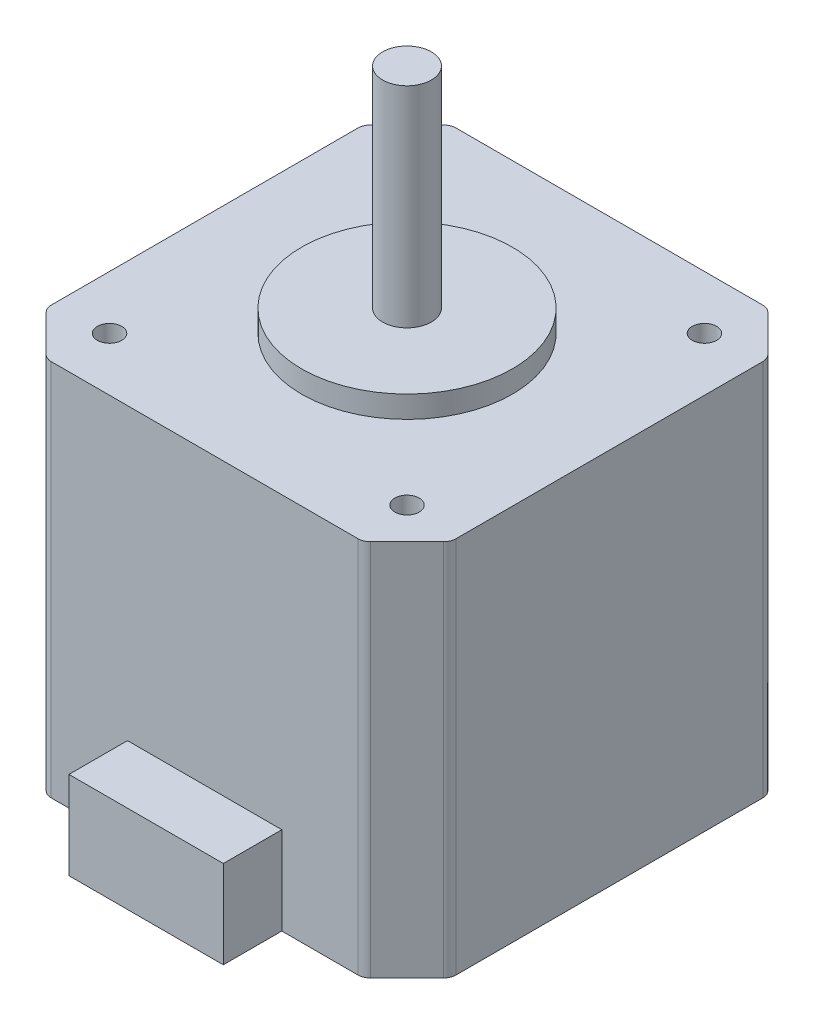
ISO-10303-21;
HEADER;
FILE_DESCRIPTION(('STEP AP214'),'2;1');
FILE_NAME('part.step','',(''),(''),'','','');
FILE_SCHEMA(('AUTOMOTIVE_DESIGN { 1 0 10303 214 1 1 1 1 }'));
ENDSEC;
DATA;
#1=APPLICATION_CONTEXT('core data for automotive mechanical design processes');
#2=APPLICATION_PROTOCOL_DEFINITION('international standard','automotive_design',2000,#1);
#3=PRODUCT_CONTEXT('',#1,'mechanical');
#4=PRODUCT('Part','Part','',(#3));
#5=PRODUCT_RELATED_PRODUCT_CATEGORY('part','',(#4));
#6=PRODUCT_DEFINITION_FORMATION('','',#4);
#7=PRODUCT_DEFINITION_CONTEXT('part definition',#1,'design');
#8=PRODUCT_DEFINITION('design','',#6,#7);
#9=PRODUCT_DEFINITION_SHAPE('','',#8);
#10=(LENGTH_UNIT() NAMED_UNIT(*) SI_UNIT(.MILLI.,.METRE.));
#11=(NAMED_UNIT(*) PLANE_ANGLE_UNIT() SI_UNIT($,.RADIAN.));
#12=(NAMED_UNIT(*) SI_UNIT($,.STERADIAN.) SOLID_ANGLE_UNIT());
#13=UNCERTAINTY_MEASURE_WITH_UNIT(LENGTH_MEASURE(1.E-05),#10,'distance_accuracy_value','');
#14=(GEOMETRIC_REPRESENTATION_CONTEXT(3) GLOBAL_UNCERTAINTY_ASSIGNED_CONTEXT((#13)) GLOBAL_UNIT_ASSIGNED_CONTEXT((#10,
#11,#12)) REPRESENTATION_CONTEXT('',''));
#15=CARTESIAN_POINT('',(0.,0.,0.));
#16=DIRECTION('',(0.,0.,1.));
#17=DIRECTION('',(1.,0.,0.));
#18=AXIS2_PLACEMENT_3D('',#15,#16,#17);
#19=CARTESIAN_POINT('',(0.,39.37,21.082));
#20=DIRECTION('',(0.,0.,-1.));
#21=DIRECTION('',(-1.,0.,0.));
#22=AXIS2_PLACEMENT_3D('',#19,#20,#21);
#23=PLANE('',#22);
#24=DIRECTION('',(1.,0.,0.));
#25=VECTOR('',#24,1.);
#26=CARTESIAN_POINT('',(0.,0.,21.082));
#27=LINE('',#26,#25);
#28=CARTESIAN_POINT('',(8.0391,0.,21.082));
#29=VERTEX_POINT('',#28);
#30=CARTESIAN_POINT('',(15.9839487757862,0.,21.082));
#31=VERTEX_POINT('',#30);
#32=EDGE_CURVE('E185',#29,#31,#27,.T.);
#33=ORIENTED_EDGE('',*,*,#32,.T.);
#34=DIRECTION('',(0.,1.,0.));
#35=VECTOR('',#34,1.);
#36=CARTESIAN_POINT('',(15.9839487757862,39.37,21.082));
#37=LINE('',#36,#35);
#38=CARTESIAN_POINT('',(15.9839487757862,39.37,21.082));
#39=VERTEX_POINT('',#38);
#40=EDGE_CURVE('E304',#31,#39,#37,.T.);
#41=ORIENTED_EDGE('',*,*,#40,.T.);
#42=DIRECTION('',(1.,0.,0.));
#43=VECTOR('',#42,1.);
#44=CARTESIAN_POINT('',(0.,39.37,21.082));
#45=LINE('',#44,#43);
#46=CARTESIAN_POINT('',(-15.9839487757862,39.37,21.082));
#47=VERTEX_POINT('',#46);
#48=EDGE_CURVE('E217',#47,#39,#45,.T.);
#49=ORIENTED_EDGE('',*,*,#48,.F.);
#50=DIRECTION('',(0.,1.,0.));
#51=VECTOR('',#50,1.);
#52=CARTESIAN_POINT('',(-15.9839487757862,39.37,21.082));
#53=LINE('',#52,#51);
#54=CARTESIAN_POINT('',(-15.9839487757862,0.,21.082));
#55=VERTEX_POINT('',#54);
#56=EDGE_CURVE('E302',#47,#55,#53,.F.);
#57=ORIENTED_EDGE('',*,*,#56,.T.);
#58=CARTESIAN_POINT('',(-8.03909999999999,0.,21.082));
#59=VERTEX_POINT('',#58);
#60=EDGE_CURVE('E231',#55,#59,#27,.T.);
#61=ORIENTED_EDGE('',*,*,#60,.T.);
#62=DIRECTION('',(0.,-1.,0.));
#63=VECTOR('',#62,1.);
#64=CARTESIAN_POINT('',(-8.03909999999999,9.144,21.082));
#65=LINE('',#64,#63);
#66=CARTESIAN_POINT('',(-8.03909999999999,9.144,21.082));
#67=VERTEX_POINT('',#66);
#68=EDGE_CURVE('E186',#67,#59,#65,.T.);
#69=ORIENTED_EDGE('',*,*,#68,.F.);
#70=DIRECTION('',(1.,0.,0.));
#71=VECTOR('',#70,1.);
#72=CARTESIAN_POINT('',(0.,9.144,21.082));
#73=LINE('',#72,#71);
#74=CARTESIAN_POINT('',(8.0391,9.144,21.082));
#75=VERTEX_POINT('',#74);
#76=EDGE_CURVE('E191',#67,#75,#73,.T.);
#77=ORIENTED_EDGE('',*,*,#76,.T.);
#78=DIRECTION('',(0.,-1.,0.));
#79=VECTOR('',#78,1.);
#80=CARTESIAN_POINT('',(8.0391,9.144,21.082));
#81=LINE('',#80,#79);
#82=EDGE_CURVE('E177',#75,#29,#81,.T.);
#83=ORIENTED_EDGE('',*,*,#82,.T.);
#84=EDGE_LOOP('',(#33,#41,#49,#57,#61,#69,#77,#83));
#85=FACE_BOUND('',#84,.T.);
#86=ADVANCED_FACE('F38',(#85),#23,.F.);
#87=CARTESIAN_POINT('',(21.082,39.37,0.));
#88=DIRECTION('',(-1.,0.,0.));
#89=DIRECTION('',(0.,0.,1.));
#90=AXIS2_PLACEMENT_3D('',#87,#88,#89);
#91=PLANE('',#90);
#92=DIRECTION('',(0.,0.,-1.));
#93=VECTOR('',#92,1.);
#94=CARTESIAN_POINT('',(21.082,0.,0.));
#95=LINE('',#94,#93);
#96=CARTESIAN_POINT('',(21.082,0.,15.9839487757862));
#97=VERTEX_POINT('',#96);
#98=CARTESIAN_POINT('',(21.082,0.,-15.9839487757862));
#99=VERTEX_POINT('',#98);
#100=EDGE_CURVE('E233',#97,#99,#95,.T.);
#101=ORIENTED_EDGE('',*,*,#100,.T.);
#102=DIRECTION('',(0.,1.,0.));
#103=VECTOR('',#102,1.);
#104=CARTESIAN_POINT('',(21.082,39.37,-15.9839487757862));
#105=LINE('',#104,#103);
#106=CARTESIAN_POINT('',(21.082,39.37,-15.9839487757862));
#107=VERTEX_POINT('',#106);
#108=EDGE_CURVE('E295',#99,#107,#105,.T.);
#109=ORIENTED_EDGE('',*,*,#108,.T.);
#110=DIRECTION('',(0.,0.,-1.));
#111=VECTOR('',#110,1.);
#112=CARTESIAN_POINT('',(21.082,39.37,0.));
#113=LINE('',#112,#111);
#114=CARTESIAN_POINT('',(21.082,39.37,15.9839487757862));
#115=VERTEX_POINT('',#114);
#116=EDGE_CURVE('E220',#115,#107,#113,.T.);
#117=ORIENTED_EDGE('',*,*,#116,.F.);
#118=DIRECTION('',(0.,1.,0.));
#119=VECTOR('',#118,1.);
#120=CARTESIAN_POINT('',(21.082,39.37,15.9839487757862));
#121=LINE('',#120,#119);
#122=EDGE_CURVE('E293',#115,#97,#121,.F.);
#123=ORIENTED_EDGE('',*,*,#122,.T.);
#124=EDGE_LOOP('',(#101,#109,#117,#123));
#125=FACE_BOUND('',#124,.T.);
#126=ADVANCED_FACE('F386',(#125),#91,.F.);
#127=CARTESIAN_POINT('',(0.,39.37,-21.082));
#128=DIRECTION('',(0.,0.,-1.));
#129=DIRECTION('',(-1.,0.,0.));
#130=AXIS2_PLACEMENT_3D('',#127,#128,#129);
#131=PLANE('',#130);
#132=DIRECTION('',(1.,0.,0.));
#133=VECTOR('',#132,1.);
#134=CARTESIAN_POINT('',(0.,0.,-21.082));
#135=LINE('',#134,#133);
#136=CARTESIAN_POINT('',(-15.9839487757862,0.,-21.082));
#137=VERTEX_POINT('',#136);
#138=CARTESIAN_POINT('',(15.9839487757862,0.,-21.082));
#139=VERTEX_POINT('',#138);
#140=EDGE_CURVE('E236',#137,#139,#135,.T.);
#141=ORIENTED_EDGE('',*,*,#140,.F.);
#142=DIRECTION('',(0.,1.,0.));
#143=VECTOR('',#142,1.);
#144=CARTESIAN_POINT('',(-15.9839487757862,39.37,-21.082));
#145=LINE('',#144,#143);
#146=CARTESIAN_POINT('',(-15.9839487757862,39.37,-21.082));
#147=VERTEX_POINT('',#146);
#148=EDGE_CURVE('E285',#137,#147,#145,.T.);
#149=ORIENTED_EDGE('',*,*,#148,.T.);
#150=DIRECTION('',(1.,0.,0.));
#151=VECTOR('',#150,1.);
#152=CARTESIAN_POINT('',(0.,39.37,-21.082));
#153=LINE('',#152,#151);
#154=CARTESIAN_POINT('',(15.9839487757862,39.37,-21.082));
#155=VERTEX_POINT('',#154);
#156=EDGE_CURVE('E224',#147,#155,#153,.T.);
#157=ORIENTED_EDGE('',*,*,#156,.T.);
#158=DIRECTION('',(0.,1.,0.));
#159=VECTOR('',#158,1.);
#160=CARTESIAN_POINT('',(15.9839487757862,0.,-21.082));
#161=LINE('',#160,#159);
#162=EDGE_CURVE('E283',#155,#139,#161,.F.);
#163=ORIENTED_EDGE('',*,*,#162,.T.);
#164=EDGE_LOOP('',(#141,#149,#157,#163));
#165=FACE_BOUND('',#164,.T.);
#166=ADVANCED_FACE('F381',(#165),#131,.T.);
#167=CARTESIAN_POINT('',(-21.082,39.37,0.));
#168=DIRECTION('',(-1.,0.,0.));
#169=DIRECTION('',(0.,0.,1.));
#170=AXIS2_PLACEMENT_3D('',#167,#168,#169);
#171=PLANE('',#170);
#172=DIRECTION('',(0.,0.,-1.));
#173=VECTOR('',#172,1.);
#174=CARTESIAN_POINT('',(-21.082,39.37,0.));
#175=LINE('',#174,#173);
#176=CARTESIAN_POINT('',(-21.082,39.37,15.9839487757862));
#177=VERTEX_POINT('',#176);
#178=CARTESIAN_POINT('',(-21.082,39.37,-15.9839487757862));
#179=VERTEX_POINT('',#178);
#180=EDGE_CURVE('E227',#177,#179,#175,.T.);
#181=ORIENTED_EDGE('',*,*,#180,.T.);
#182=DIRECTION('',(0.,1.,0.));
#183=VECTOR('',#182,1.);
#184=CARTESIAN_POINT('',(-21.082,0.,-15.9839487757862));
#185=LINE('',#184,#183);
#186=CARTESIAN_POINT('',(-21.082,0.,-15.9839487757862));
#187=VERTEX_POINT('',#186);
#188=EDGE_CURVE('E266',#179,#187,#185,.F.);
#189=ORIENTED_EDGE('',*,*,#188,.T.);
#190=DIRECTION('',(0.,0.,-1.));
#191=VECTOR('',#190,1.);
#192=CARTESIAN_POINT('',(-21.082,0.,0.));
#193=LINE('',#192,#191);
#194=CARTESIAN_POINT('',(-21.082,0.,15.9839487757862));
#195=VERTEX_POINT('',#194);
#196=EDGE_CURVE('E221',#195,#187,#193,.T.);
#197=ORIENTED_EDGE('',*,*,#196,.F.);
#198=DIRECTION('',(0.,1.,0.));
#199=VECTOR('',#198,1.);
#200=CARTESIAN_POINT('',(-21.082,39.37,15.9839487757862));
#201=LINE('',#200,#199);
#202=EDGE_CURVE('E263',#195,#177,#201,.T.);
#203=ORIENTED_EDGE('',*,*,#202,.T.);
#204=EDGE_LOOP('',(#181,#189,#197,#203));
#205=FACE_BOUND('',#204,.T.);
#206=ADVANCED_FACE('F374',(#205),#171,.T.);
#207=CARTESIAN_POINT('',(0.,39.37,0.));
#208=DIRECTION('',(0.,1.,0.));
#209=DIRECTION('',(0.,0.,1.));
#210=AXIS2_PLACEMENT_3D('',#207,#208,#209);
#211=PLANE('',#210);
#212=DIRECTION('',(0.707106781186548,0.,-0.707106781186548));
#213=VECTOR('',#212,1.);
#214=CARTESIAN_POINT('',(-21.082,39.37,-16.51));
#215=LINE('',#214,#213);
#216=CARTESIAN_POINT('',(-20.7100256121069,39.37,-16.8819743878931));
#217=VERTEX_POINT('',#216);
#218=CARTESIAN_POINT('',(-16.8819743878931,39.37,-20.7100256121069));
#219=VERTEX_POINT('',#218);
#220=EDGE_CURVE('E334',#217,#219,#215,.T.);
#221=ORIENTED_EDGE('',*,*,#220,.F.);
#222=CARTESIAN_POINT('',(-19.812,39.37,-15.9839487757862));
#223=DIRECTION('',(0.,1.,0.));
#224=DIRECTION('',(0.,0.,1.));
#225=AXIS2_PLACEMENT_3D('',#222,#223,#224);
#226=CIRCLE('',#225,1.27);
#227=EDGE_CURVE('E261',#217,#179,#226,.T.);
#228=ORIENTED_EDGE('',*,*,#227,.T.);
#229=ORIENTED_EDGE('',*,*,#180,.F.);
#230=CARTESIAN_POINT('',(-19.812,39.37,15.9839487757862));
#231=DIRECTION('',(0.,1.,0.));
#232=DIRECTION('',(0.,0.,1.));
#233=AXIS2_PLACEMENT_3D('',#230,#231,#232);
#234=CIRCLE('',#233,1.27);
#235=CARTESIAN_POINT('',(-20.7100256121069,39.37,16.8819743878931));
#236=VERTEX_POINT('',#235);
#237=EDGE_CURVE('E249',#177,#236,#234,.T.);
#238=ORIENTED_EDGE('',*,*,#237,.T.);
#239=DIRECTION('',(-0.707106781186548,0.,-0.707106781186548));
#240=VECTOR('',#239,1.);
#241=CARTESIAN_POINT('',(-16.51,39.37,21.082));
#242=LINE('',#241,#240);
#243=CARTESIAN_POINT('',(-16.8819743878931,39.37,20.7100256121069));
#244=VERTEX_POINT('',#243);
#245=EDGE_CURVE('E313',#244,#236,#242,.T.);
#246=ORIENTED_EDGE('',*,*,#245,.F.);
#247=CARTESIAN_POINT('',(-15.9839487757862,39.37,19.812));
#248=DIRECTION('',(0.,1.,0.));
#249=DIRECTION('',(0.,0.,1.));
#250=AXIS2_PLACEMENT_3D('',#247,#248,#249);
#251=CIRCLE('',#250,1.27);
#252=EDGE_CURVE('E247',#244,#47,#251,.T.);
#253=ORIENTED_EDGE('',*,*,#252,.T.);
#254=ORIENTED_EDGE('',*,*,#48,.T.);
#255=CARTESIAN_POINT('',(15.9839487757862,39.37,19.812));
#256=DIRECTION('',(0.,1.,0.));
#257=DIRECTION('',(0.,0.,1.));
#258=AXIS2_PLACEMENT_3D('',#255,#256,#257);
#259=CIRCLE('',#258,1.27);
#260=CARTESIAN_POINT('',(16.8819743878931,39.37,20.7100256121069));
#261=VERTEX_POINT('',#260);
#262=EDGE_CURVE('E251',#39,#261,#259,.T.);
#263=ORIENTED_EDGE('',*,*,#262,.T.);
#264=DIRECTION('',(-0.707106781186548,0.,0.707106781186548));
#265=VECTOR('',#264,1.);
#266=CARTESIAN_POINT('',(21.082,39.37,16.51));
#267=LINE('',#266,#265);
#268=CARTESIAN_POINT('',(20.7100256121069,39.37,16.8819743878931));
#269=VERTEX_POINT('',#268);
#270=EDGE_CURVE('E326',#269,#261,#267,.T.);
#271=ORIENTED_EDGE('',*,*,#270,.F.);
#272=CARTESIAN_POINT('',(19.812,39.37,15.9839487757862));
#273=DIRECTION('',(0.,1.,0.));
#274=DIRECTION('',(0.,0.,1.));
#275=AXIS2_PLACEMENT_3D('',#272,#273,#274);
#276=CIRCLE('',#275,1.27);
#277=EDGE_CURVE('E253',#269,#115,#276,.T.);
#278=ORIENTED_EDGE('',*,*,#277,.T.);
#279=ORIENTED_EDGE('',*,*,#116,.T.);
#280=CARTESIAN_POINT('',(19.812,39.37,-15.9839487757862));
#281=DIRECTION('',(0.,1.,0.));
#282=DIRECTION('',(0.,0.,1.));
#283=AXIS2_PLACEMENT_3D('',#280,#281,#282);
#284=CIRCLE('',#283,1.27);
#285=CARTESIAN_POINT('',(20.7100256121069,39.37,-16.8819743878931));
#286=VERTEX_POINT('',#285);
#287=EDGE_CURVE('E255',#107,#286,#284,.T.);
#288=ORIENTED_EDGE('',*,*,#287,.T.);
#289=DIRECTION('',(0.707106781186548,0.,0.707106781186548));
#290=VECTOR('',#289,1.);
#291=CARTESIAN_POINT('',(16.51,39.37,-21.082));
#292=LINE('',#291,#290);
#293=CARTESIAN_POINT('',(16.8819743878931,39.37,-20.7100256121069));
#294=VERTEX_POINT('',#293);
#295=EDGE_CURVE('E450',#294,#286,#292,.T.);
#296=ORIENTED_EDGE('',*,*,#295,.F.);
#297=CARTESIAN_POINT('',(15.9839487757862,39.37,-19.812));
#298=DIRECTION('',(0.,1.,0.));
#299=DIRECTION('',(0.,0.,1.));
#300=AXIS2_PLACEMENT_3D('',#297,#298,#299);
#301=CIRCLE('',#300,1.27);
#302=EDGE_CURVE('E257',#294,#155,#301,.T.);
#303=ORIENTED_EDGE('',*,*,#302,.T.);
#304=ORIENTED_EDGE('',*,*,#156,.F.);
#305=CARTESIAN_POINT('',(-15.9839487757862,39.37,-19.812));
#306=DIRECTION('',(0.,1.,0.));
#307=DIRECTION('',(0.,0.,1.));
#308=AXIS2_PLACEMENT_3D('',#305,#306,#307);
#309=CIRCLE('',#308,1.27);
#310=EDGE_CURVE('E259',#147,#219,#309,.T.);
#311=ORIENTED_EDGE('',*,*,#310,.T.);
#312=EDGE_LOOP('',(#221,#228,#229,#238,#246,#253,#254,#263,#271,#278,#279,#288,#296,#303,#304,#311));
#313=FACE_BOUND('',#312,.T.);
#314=CARTESIAN_POINT('',(-15.494,39.37,15.494));
#315=DIRECTION('',(0.,1.,0.));
#316=DIRECTION('',(0.,0.,1.));
#317=AXIS2_PLACEMENT_3D('',#314,#315,#316);
#318=CIRCLE('',#317,1.27);
#319=CARTESIAN_POINT('',(-15.494,39.37,16.764));
#320=VERTEX_POINT('',#319);
#321=EDGE_CURVE('E333',#320,#320,#318,.T.);
#322=ORIENTED_EDGE('',*,*,#321,.F.);
#323=EDGE_LOOP('',(#322));
#324=FACE_BOUND('',#323,.T.);
#325=CARTESIAN_POINT('',(15.494,39.37,15.494));
#326=DIRECTION('',(0.,1.,0.));
#327=DIRECTION('',(0.,0.,1.));
#328=AXIS2_PLACEMENT_3D('',#325,#326,#327);
#329=CIRCLE('',#328,1.27);
#330=CARTESIAN_POINT('',(15.494,39.37,16.764));
#331=VERTEX_POINT('',#330);
#332=EDGE_CURVE('E348',#331,#331,#329,.T.);
#333=ORIENTED_EDGE('',*,*,#332,.F.);
#334=EDGE_LOOP('',(#333));
#335=FACE_BOUND('',#334,.T.);
#336=CARTESIAN_POINT('',(15.494,39.37,-15.494));
#337=DIRECTION('',(0.,1.,0.));
#338=DIRECTION('',(0.,0.,1.));
#339=AXIS2_PLACEMENT_3D('',#336,#337,#338);
#340=CIRCLE('',#339,1.27);
#341=CARTESIAN_POINT('',(15.494,39.37,-14.224));
#342=VERTEX_POINT('',#341);
#343=EDGE_CURVE('E342',#342,#342,#340,.T.);
#344=ORIENTED_EDGE('',*,*,#343,.F.);
#345=EDGE_LOOP('',(#344));
#346=FACE_BOUND('',#345,.T.);
#347=CARTESIAN_POINT('',(-15.494,39.37,-15.494));
#348=DIRECTION('',(0.,1.,0.));
#349=DIRECTION('',(0.,0.,1.));
#350=AXIS2_PLACEMENT_3D('',#347,#348,#349);
#351=CIRCLE('',#350,1.27);
#352=CARTESIAN_POINT('',(-15.494,39.37,-14.224));
#353=VERTEX_POINT('',#352);
#354=EDGE_CURVE('E341',#353,#353,#351,.T.);
#355=ORIENTED_EDGE('',*,*,#354,.F.);
#356=EDGE_LOOP('',(#355));
#357=FACE_BOUND('',#356,.T.);
#358=CARTESIAN_POINT('',(0.,39.37,0.));
#359=DIRECTION('',(0.,1.,0.));
#360=DIRECTION('',(0.,0.,1.));
#361=AXIS2_PLACEMENT_3D('',#358,#359,#360);
#362=CIRCLE('',#361,10.9855);
#363=CARTESIAN_POINT('',(0.,39.37,10.9855));
#364=VERTEX_POINT('',#363);
#365=EDGE_CURVE('E230',#364,#364,#362,.T.);
#366=ORIENTED_EDGE('',*,*,#365,.F.);
#367=EDGE_LOOP('',(#366));
#368=FACE_BOUND('',#367,.T.);
#369=ADVANCED_FACE('F321',(#313,#324,#335,#346,#357,#368),#211,.T.);
#370=CARTESIAN_POINT('',(0.,0.,0.));
#371=DIRECTION('',(0.,1.,0.));
#372=DIRECTION('',(0.,0.,1.));
#373=AXIS2_PLACEMENT_3D('',#370,#371,#372);
#374=PLANE('',#373);
#375=ORIENTED_EDGE('',*,*,#196,.T.);
#376=CARTESIAN_POINT('',(-19.812,0.,-15.9839487757862));
#377=DIRECTION('',(0.,1.,0.));
#378=DIRECTION('',(0.,0.,1.));
#379=AXIS2_PLACEMENT_3D('',#376,#377,#378);
#380=CIRCLE('',#379,1.27);
#381=CARTESIAN_POINT('',(-20.7100256121069,0.,-16.8819743878931));
#382=VERTEX_POINT('',#381);
#383=EDGE_CURVE('E281',#187,#382,#380,.F.);
#384=ORIENTED_EDGE('',*,*,#383,.T.);
#385=DIRECTION('',(0.707106781186548,0.,-0.707106781186548));
#386=VECTOR('',#385,1.);
#387=CARTESIAN_POINT('',(-21.082,0.,-16.51));
#388=LINE('',#387,#386);
#389=CARTESIAN_POINT('',(-16.8819743878931,0.,-20.7100256121069));
#390=VERTEX_POINT('',#389);
#391=EDGE_CURVE('E330',#382,#390,#388,.T.);
#392=ORIENTED_EDGE('',*,*,#391,.T.);
#393=CARTESIAN_POINT('',(-15.9839487757862,0.,-19.812));
#394=DIRECTION('',(0.,1.,0.));
#395=DIRECTION('',(0.,0.,1.));
#396=AXIS2_PLACEMENT_3D('',#393,#394,#395);
#397=CIRCLE('',#396,1.27);
#398=EDGE_CURVE('E279',#390,#137,#397,.F.);
#399=ORIENTED_EDGE('',*,*,#398,.T.);
#400=ORIENTED_EDGE('',*,*,#140,.T.);
#401=CARTESIAN_POINT('',(15.9839487757862,0.,-19.812));
#402=DIRECTION('',(0.,1.,0.));
#403=DIRECTION('',(0.,0.,1.));
#404=AXIS2_PLACEMENT_3D('',#401,#402,#403);
#405=CIRCLE('',#404,1.27);
#406=CARTESIAN_POINT('',(16.8819743878931,0.,-20.7100256121069));
#407=VERTEX_POINT('',#406);
#408=EDGE_CURVE('E277',#139,#407,#405,.F.);
#409=ORIENTED_EDGE('',*,*,#408,.T.);
#410=DIRECTION('',(0.707106781186548,0.,0.707106781186548));
#411=VECTOR('',#410,1.);
#412=CARTESIAN_POINT('',(16.51,0.,-21.082));
#413=LINE('',#412,#411);
#414=CARTESIAN_POINT('',(20.7100256121069,0.,-16.8819743878931));
#415=VERTEX_POINT('',#414);
#416=EDGE_CURVE('E337',#407,#415,#413,.T.);
#417=ORIENTED_EDGE('',*,*,#416,.T.);
#418=CARTESIAN_POINT('',(19.812,0.,-15.9839487757862));
#419=DIRECTION('',(0.,1.,0.));
#420=DIRECTION('',(0.,0.,1.));
#421=AXIS2_PLACEMENT_3D('',#418,#419,#420);
#422=CIRCLE('',#421,1.27);
#423=EDGE_CURVE('E275',#415,#99,#422,.F.);
#424=ORIENTED_EDGE('',*,*,#423,.T.);
#425=ORIENTED_EDGE('',*,*,#100,.F.);
#426=CARTESIAN_POINT('',(19.812,0.,15.9839487757862));
#427=DIRECTION('',(0.,1.,0.));
#428=DIRECTION('',(0.,0.,1.));
#429=AXIS2_PLACEMENT_3D('',#426,#427,#428);
#430=CIRCLE('',#429,1.27);
#431=CARTESIAN_POINT('',(20.7100256121069,0.,16.8819743878931));
#432=VERTEX_POINT('',#431);
#433=EDGE_CURVE('E273',#97,#432,#430,.F.);
#434=ORIENTED_EDGE('',*,*,#433,.T.);
#435=DIRECTION('',(-0.707106781186548,0.,0.707106781186548));
#436=VECTOR('',#435,1.);
#437=CARTESIAN_POINT('',(21.082,0.,16.51));
#438=LINE('',#437,#436);
#439=CARTESIAN_POINT('',(16.8819743878931,0.,20.7100256121069));
#440=VERTEX_POINT('',#439);
#441=EDGE_CURVE('E452',#432,#440,#438,.T.);
#442=ORIENTED_EDGE('',*,*,#441,.T.);
#443=CARTESIAN_POINT('',(15.9839487757862,0.,19.812));
#444=DIRECTION('',(0.,1.,0.));
#445=DIRECTION('',(0.,0.,1.));
#446=AXIS2_PLACEMENT_3D('',#443,#444,#445);
#447=CIRCLE('',#446,1.27);
#448=EDGE_CURVE('E53',#440,#31,#447,.F.);
#449=ORIENTED_EDGE('',*,*,#448,.T.);
#450=ORIENTED_EDGE('',*,*,#32,.F.);
#451=DIRECTION('',(0.,0.,1.));
#452=VECTOR('',#451,1.);
#453=CARTESIAN_POINT('',(8.0391,0.,0.));
#454=LINE('',#453,#452);
#455=CARTESIAN_POINT('',(8.0391,0.,27.178));
#456=VERTEX_POINT('',#455);
#457=EDGE_CURVE('E182',#29,#456,#454,.T.);
#458=ORIENTED_EDGE('',*,*,#457,.T.);
#459=DIRECTION('',(1.,0.,0.));
#460=VECTOR('',#459,1.);
#461=CARTESIAN_POINT('',(0.,0.,27.178));
#462=LINE('',#461,#460);
#463=CARTESIAN_POINT('',(-8.0391,0.,27.178));
#464=VERTEX_POINT('',#463);
#465=EDGE_CURVE('E196',#464,#456,#462,.T.);
#466=ORIENTED_EDGE('',*,*,#465,.F.);
#467=DIRECTION('',(0.,0.,1.));
#468=VECTOR('',#467,1.);
#469=CARTESIAN_POINT('',(-8.03909999999998,0.,0.));
#470=LINE('',#469,#468);
#471=EDGE_CURVE('E207',#59,#464,#470,.T.);
#472=ORIENTED_EDGE('',*,*,#471,.F.);
#473=ORIENTED_EDGE('',*,*,#60,.F.);
#474=CARTESIAN_POINT('',(-15.9839487757862,0.,19.812));
#475=DIRECTION('',(0.,1.,0.));
#476=DIRECTION('',(0.,0.,1.));
#477=AXIS2_PLACEMENT_3D('',#474,#475,#476);
#478=CIRCLE('',#477,1.27);
#479=CARTESIAN_POINT('',(-16.8819743878931,0.,20.7100256121069));
#480=VERTEX_POINT('',#479);
#481=EDGE_CURVE('E268',#55,#480,#478,.F.);
#482=ORIENTED_EDGE('',*,*,#481,.T.);
#483=DIRECTION('',(-0.707106781186548,0.,-0.707106781186548));
#484=VECTOR('',#483,1.);
#485=CARTESIAN_POINT('',(-16.51,0.,21.082));
#486=LINE('',#485,#484);
#487=CARTESIAN_POINT('',(-20.7100256121069,0.,16.8819743878931));
#488=VERTEX_POINT('',#487);
#489=EDGE_CURVE('E316',#480,#488,#486,.T.);
#490=ORIENTED_EDGE('',*,*,#489,.T.);
#491=CARTESIAN_POINT('',(-19.812,0.,15.9839487757862));
#492=DIRECTION('',(0.,1.,0.));
#493=DIRECTION('',(0.,0.,1.));
#494=AXIS2_PLACEMENT_3D('',#491,#492,#493);
#495=CIRCLE('',#494,1.27);
#496=EDGE_CURVE('E270',#488,#195,#495,.F.);
#497=ORIENTED_EDGE('',*,*,#496,.T.);
#498=EDGE_LOOP('',(#375,#384,#392,#399,#400,#409,#417,#424,#425,#434,#442,#449,#450,#458,#466,
#472,#473,#482,#490,#497));
#499=FACE_BOUND('',#498,.T.);
#500=ADVANCED_FACE('F373',(#499),#374,.F.);
#501=CARTESIAN_POINT('',(8.0391,9.144,0.));
#502=DIRECTION('',(1.,0.,0.));
#503=DIRECTION('',(0.,0.,-1.));
#504=AXIS2_PLACEMENT_3D('',#501,#502,#503);
#505=PLANE('',#504);
#506=ORIENTED_EDGE('',*,*,#457,.F.);
#507=ORIENTED_EDGE('',*,*,#82,.F.);
#508=DIRECTION('',(0.,0.,1.));
#509=VECTOR('',#508,1.);
#510=CARTESIAN_POINT('',(8.0391,9.144,0.));
#511=LINE('',#510,#509);
#512=CARTESIAN_POINT('',(8.0391,9.144,27.178));
#513=VERTEX_POINT('',#512);
#514=EDGE_CURVE('E180',#75,#513,#511,.T.);
#515=ORIENTED_EDGE('',*,*,#514,.T.);
#516=DIRECTION('',(0.,-1.,0.));
#517=VECTOR('',#516,1.);
#518=CARTESIAN_POINT('',(8.0391,9.144,27.178));
#519=LINE('',#518,#517);
#520=EDGE_CURVE('E205',#513,#456,#519,.T.);
#521=ORIENTED_EDGE('',*,*,#520,.T.);
#522=EDGE_LOOP('',(#506,#507,#515,#521));
#523=FACE_BOUND('',#522,.T.);
#524=ADVANCED_FACE('F179',(#523),#505,.T.);
#525=CARTESIAN_POINT('',(-8.03909999999998,9.144,0.));
#526=DIRECTION('',(1.,0.,0.));
#527=DIRECTION('',(0.,0.,-1.));
#528=AXIS2_PLACEMENT_3D('',#525,#526,#527);
#529=PLANE('',#528);
#530=ORIENTED_EDGE('',*,*,#471,.T.);
#531=DIRECTION('',(0.,-1.,0.));
#532=VECTOR('',#531,1.);
#533=CARTESIAN_POINT('',(-8.0391,9.144,27.178));
#534=LINE('',#533,#532);
#535=CARTESIAN_POINT('',(-8.0391,9.144,27.178));
#536=VERTEX_POINT('',#535);
#537=EDGE_CURVE('E213',#536,#464,#534,.T.);
#538=ORIENTED_EDGE('',*,*,#537,.F.);
#539=DIRECTION('',(0.,0.,1.));
#540=VECTOR('',#539,1.);
#541=CARTESIAN_POINT('',(-8.03909999999998,9.144,0.));
#542=LINE('',#541,#540);
#543=EDGE_CURVE('E199',#67,#536,#542,.T.);
#544=ORIENTED_EDGE('',*,*,#543,.F.);
#545=ORIENTED_EDGE('',*,*,#68,.T.);
#546=EDGE_LOOP('',(#530,#538,#544,#545));
#547=FACE_BOUND('',#546,.T.);
#548=ADVANCED_FACE('F467',(#547),#529,.F.);
#549=CARTESIAN_POINT('',(0.,9.144,27.178));
#550=DIRECTION('',(0.,0.,-1.));
#551=DIRECTION('',(-1.,0.,0.));
#552=AXIS2_PLACEMENT_3D('',#549,#550,#551);
#553=PLANE('',#552);
#554=ORIENTED_EDGE('',*,*,#465,.T.);
#555=ORIENTED_EDGE('',*,*,#520,.F.);
#556=DIRECTION('',(1.,0.,0.));
#557=VECTOR('',#556,1.);
#558=CARTESIAN_POINT('',(0.,9.144,27.178));
#559=LINE('',#558,#557);
#560=EDGE_CURVE('E194',#536,#513,#559,.T.);
#561=ORIENTED_EDGE('',*,*,#560,.F.);
#562=ORIENTED_EDGE('',*,*,#537,.T.);
#563=EDGE_LOOP('',(#554,#555,#561,#562));
#564=FACE_BOUND('',#563,.T.);
#565=ADVANCED_FACE('F464',(#564),#553,.F.);
#566=CARTESIAN_POINT('',(0.,9.144,0.));
#567=DIRECTION('',(0.,1.,0.));
#568=DIRECTION('',(0.,0.,1.));
#569=AXIS2_PLACEMENT_3D('',#566,#567,#568);
#570=PLANE('',#569);
#571=ORIENTED_EDGE('',*,*,#514,.F.);
#572=ORIENTED_EDGE('',*,*,#76,.F.);
#573=ORIENTED_EDGE('',*,*,#543,.T.);
#574=ORIENTED_EDGE('',*,*,#560,.T.);
#575=EDGE_LOOP('',(#571,#572,#573,#574));
#576=FACE_BOUND('',#575,.T.);
#577=ADVANCED_FACE('F190',(#576),#570,.T.);
#578=CARTESIAN_POINT('',(0.,41.656,0.));
#579=DIRECTION('',(0.,-1.,0.));
#580=DIRECTION('',(0.,0.,-1.));
#581=AXIS2_PLACEMENT_3D('',#578,#579,#580);
#582=CYLINDRICAL_SURFACE('',#581,10.9855);
#583=CARTESIAN_POINT('',(0.,41.656,0.));
#584=DIRECTION('',(0.,1.,0.));
#585=DIRECTION('',(0.,0.,1.));
#586=AXIS2_PLACEMENT_3D('',#583,#584,#585);
#587=CIRCLE('',#586,10.9855);
#588=CARTESIAN_POINT('',(0.,41.656,10.9855));
#589=VERTEX_POINT('',#588);
#590=EDGE_CURVE('E208',#589,#589,#587,.T.);
#591=ORIENTED_EDGE('',*,*,#590,.F.);
#592=EDGE_LOOP('',(#591));
#593=FACE_BOUND('',#592,.T.);
#594=ORIENTED_EDGE('',*,*,#365,.T.);
#595=EDGE_LOOP('',(#594));
#596=FACE_BOUND('',#595,.T.);
#597=ADVANCED_FACE('F370',(#593,#596),#582,.T.);
#598=CARTESIAN_POINT('',(0.,41.656,0.));
#599=DIRECTION('',(0.,1.,0.));
#600=DIRECTION('',(0.,0.,1.));
#601=AXIS2_PLACEMENT_3D('',#598,#599,#600);
#602=PLANE('',#601);
#603=CARTESIAN_POINT('',(0.,41.656,0.));
#604=DIRECTION('',(0.,1.,0.));
#605=DIRECTION('',(0.,0.,1.));
#606=AXIS2_PLACEMENT_3D('',#603,#604,#605);
#607=CIRCLE('',#606,2.54);
#608=CARTESIAN_POINT('',(0.,41.656,2.54));
#609=VERTEX_POINT('',#608);
#610=EDGE_CURVE('E244',#609,#609,#607,.T.);
#611=ORIENTED_EDGE('',*,*,#610,.F.);
#612=EDGE_LOOP('',(#611));
#613=FACE_BOUND('',#612,.T.);
#614=ORIENTED_EDGE('',*,*,#590,.T.);
#615=EDGE_LOOP('',(#614));
#616=FACE_BOUND('',#615,.T.);
#617=ADVANCED_FACE('F480',(#613,#616),#602,.T.);
#618=CARTESIAN_POINT('',(0.,63.5,0.));
#619=DIRECTION('',(0.,-1.,0.));
#620=DIRECTION('',(0.,0.,-1.));
#621=AXIS2_PLACEMENT_3D('',#618,#619,#620);
#622=CYLINDRICAL_SURFACE('',#621,2.54);
#623=CARTESIAN_POINT('',(0.,63.5,0.));
#624=DIRECTION('',(0.,1.,0.));
#625=DIRECTION('',(0.,0.,1.));
#626=AXIS2_PLACEMENT_3D('',#623,#624,#625);
#627=CIRCLE('',#626,2.54);
#628=CARTESIAN_POINT('',(0.,63.5,2.54));
#629=VERTEX_POINT('',#628);
#630=EDGE_CURVE('E359',#629,#629,#627,.T.);
#631=ORIENTED_EDGE('',*,*,#630,.F.);
#632=EDGE_LOOP('',(#631));
#633=FACE_BOUND('',#632,.T.);
#634=ORIENTED_EDGE('',*,*,#610,.T.);
#635=EDGE_LOOP('',(#634));
#636=FACE_BOUND('',#635,.T.);
#637=ADVANCED_FACE('F484',(#633,#636),#622,.T.);
#638=CARTESIAN_POINT('',(0.,63.5,0.));
#639=DIRECTION('',(0.,1.,0.));
#640=DIRECTION('',(0.,0.,1.));
#641=AXIS2_PLACEMENT_3D('',#638,#639,#640);
#642=PLANE('',#641);
#643=ORIENTED_EDGE('',*,*,#630,.T.);
#644=EDGE_LOOP('',(#643));
#645=FACE_BOUND('',#644,.T.);
#646=ADVANCED_FACE('F488',(#645),#642,.T.);
#647=CARTESIAN_POINT('',(-15.494,33.02,-15.494));
#648=DIRECTION('',(0.,1.,0.));
#649=DIRECTION('',(0.,0.,1.));
#650=AXIS2_PLACEMENT_3D('',#647,#648,#649);
#651=CYLINDRICAL_SURFACE('',#650,1.27);
#652=CARTESIAN_POINT('',(-15.494,33.02,-15.494));
#653=DIRECTION('',(0.,1.,0.));
#654=DIRECTION('',(0.,0.,1.));
#655=AXIS2_PLACEMENT_3D('',#652,#653,#654);
#656=CIRCLE('',#655,1.27);
#657=CARTESIAN_POINT('',(-15.494,33.02,-14.224));
#658=VERTEX_POINT('',#657);
#659=EDGE_CURVE('E356',#658,#658,#656,.T.);
#660=ORIENTED_EDGE('',*,*,#659,.F.);
#661=EDGE_LOOP('',(#660));
#662=FACE_BOUND('',#661,.T.);
#663=ORIENTED_EDGE('',*,*,#354,.T.);
#664=EDGE_LOOP('',(#663));
#665=FACE_BOUND('',#664,.T.);
#666=ADVANCED_FACE('F492',(#662,#665),#651,.F.);
#667=CARTESIAN_POINT('',(-15.494,33.02,-15.494));
#668=DIRECTION('',(0.,1.,0.));
#669=DIRECTION('',(0.,0.,1.));
#670=AXIS2_PLACEMENT_3D('',#667,#668,#669);
#671=PLANE('',#670);
#672=ORIENTED_EDGE('',*,*,#659,.T.);
#673=EDGE_LOOP('',(#672));
#674=FACE_BOUND('',#673,.T.);
#675=ADVANCED_FACE('F496',(#674),#671,.T.);
#676=CARTESIAN_POINT('',(15.494,33.02,-15.494));
#677=DIRECTION('',(0.,1.,0.));
#678=DIRECTION('',(0.,0.,1.));
#679=AXIS2_PLACEMENT_3D('',#676,#677,#678);
#680=CYLINDRICAL_SURFACE('',#679,1.27);
#681=CARTESIAN_POINT('',(15.494,33.02,-15.494));
#682=DIRECTION('',(0.,1.,0.));
#683=DIRECTION('',(0.,0.,1.));
#684=AXIS2_PLACEMENT_3D('',#681,#682,#683);
#685=CIRCLE('',#684,1.27);
#686=CARTESIAN_POINT('',(15.494,33.02,-14.224));
#687=VERTEX_POINT('',#686);
#688=EDGE_CURVE('E338',#687,#687,#685,.T.);
#689=ORIENTED_EDGE('',*,*,#688,.F.);
#690=EDGE_LOOP('',(#689));
#691=FACE_BOUND('',#690,.T.);
#692=ORIENTED_EDGE('',*,*,#343,.T.);
#693=EDGE_LOOP('',(#692));
#694=FACE_BOUND('',#693,.T.);
#695=ADVANCED_FACE('F500',(#691,#694),#680,.F.);
#696=CARTESIAN_POINT('',(15.494,33.02,-15.494));
#697=DIRECTION('',(0.,1.,0.));
#698=DIRECTION('',(0.,0.,1.));
#699=AXIS2_PLACEMENT_3D('',#696,#697,#698);
#700=PLANE('',#699);
#701=ORIENTED_EDGE('',*,*,#688,.T.);
#702=EDGE_LOOP('',(#701));
#703=FACE_BOUND('',#702,.T.);
#704=ADVANCED_FACE('F514',(#703),#700,.T.);
#705=CARTESIAN_POINT('',(15.494,33.02,15.494));
#706=DIRECTION('',(0.,1.,0.));
#707=DIRECTION('',(0.,0.,1.));
#708=AXIS2_PLACEMENT_3D('',#705,#706,#707);
#709=CYLINDRICAL_SURFACE('',#708,1.27);
#710=CARTESIAN_POINT('',(15.494,33.02,15.494));
#711=DIRECTION('',(0.,1.,0.));
#712=DIRECTION('',(0.,0.,1.));
#713=AXIS2_PLACEMENT_3D('',#710,#711,#712);
#714=CIRCLE('',#713,1.27);
#715=CARTESIAN_POINT('',(15.494,33.02,16.764));
#716=VERTEX_POINT('',#715);
#717=EDGE_CURVE('E345',#716,#716,#714,.T.);
#718=ORIENTED_EDGE('',*,*,#717,.F.);
#719=EDGE_LOOP('',(#718));
#720=FACE_BOUND('',#719,.T.);
#721=ORIENTED_EDGE('',*,*,#332,.T.);
#722=EDGE_LOOP('',(#721));
#723=FACE_BOUND('',#722,.T.);
#724=ADVANCED_FACE('F511',(#720,#723),#709,.F.);
#725=CARTESIAN_POINT('',(15.494,33.02,15.494));
#726=DIRECTION('',(0.,1.,0.));
#727=DIRECTION('',(0.,0.,1.));
#728=AXIS2_PLACEMENT_3D('',#725,#726,#727);
#729=PLANE('',#728);
#730=ORIENTED_EDGE('',*,*,#717,.T.);
#731=EDGE_LOOP('',(#730));
#732=FACE_BOUND('',#731,.T.);
#733=ADVANCED_FACE('F506',(#732),#729,.T.);
#734=CARTESIAN_POINT('',(-15.494,33.02,15.494));
#735=DIRECTION('',(0.,1.,0.));
#736=DIRECTION('',(0.,0.,1.));
#737=AXIS2_PLACEMENT_3D('',#734,#735,#736);
#738=CYLINDRICAL_SURFACE('',#737,1.27);
#739=CARTESIAN_POINT('',(-15.494,33.02,15.494));
#740=DIRECTION('',(0.,1.,0.));
#741=DIRECTION('',(0.,0.,1.));
#742=AXIS2_PLACEMENT_3D('',#739,#740,#741);
#743=CIRCLE('',#742,1.27);
#744=CARTESIAN_POINT('',(-15.494,33.02,16.764));
#745=VERTEX_POINT('',#744);
#746=EDGE_CURVE('E351',#745,#745,#743,.T.);
#747=ORIENTED_EDGE('',*,*,#746,.F.);
#748=EDGE_LOOP('',(#747));
#749=FACE_BOUND('',#748,.T.);
#750=ORIENTED_EDGE('',*,*,#321,.T.);
#751=EDGE_LOOP('',(#750));
#752=FACE_BOUND('',#751,.T.);
#753=ADVANCED_FACE('F502',(#749,#752),#738,.F.);
#754=CARTESIAN_POINT('',(-15.494,33.02,15.494));
#755=DIRECTION('',(0.,1.,0.));
#756=DIRECTION('',(0.,0.,1.));
#757=AXIS2_PLACEMENT_3D('',#754,#755,#756);
#758=PLANE('',#757);
#759=ORIENTED_EDGE('',*,*,#746,.T.);
#760=EDGE_LOOP('',(#759));
#761=FACE_BOUND('',#760,.T.);
#762=ADVANCED_FACE('F505',(#761),#758,.T.);
#763=CARTESIAN_POINT('',(-21.082,0.,-16.51));
#764=DIRECTION('',(0.707106781186548,0.,0.707106781186548));
#765=DIRECTION('',(0.707106781186548,0.,-0.707106781186548));
#766=AXIS2_PLACEMENT_3D('',#763,#764,#765);
#767=PLANE('',#766);
#768=ORIENTED_EDGE('',*,*,#391,.F.);
#769=DIRECTION('',(0.,1.,0.));
#770=VECTOR('',#769,1.);
#771=CARTESIAN_POINT('',(-20.7100256121069,39.37,-16.8819743878931));
#772=LINE('',#771,#770);
#773=EDGE_CURVE('E243',#382,#217,#772,.T.);
#774=ORIENTED_EDGE('',*,*,#773,.T.);
#775=ORIENTED_EDGE('',*,*,#220,.T.);
#776=DIRECTION('',(0.,1.,0.));
#777=VECTOR('',#776,1.);
#778=CARTESIAN_POINT('',(-16.8819743878931,0.,-20.7100256121069));
#779=LINE('',#778,#777);
#780=EDGE_CURVE('E241',#219,#390,#779,.F.);
#781=ORIENTED_EDGE('',*,*,#780,.T.);
#782=EDGE_LOOP('',(#768,#774,#775,#781));
#783=FACE_BOUND('',#782,.T.);
#784=ADVANCED_FACE('F433',(#783),#767,.F.);
#785=CARTESIAN_POINT('',(16.51,0.,-21.082));
#786=DIRECTION('',(-0.707106781186548,0.,0.707106781186548));
#787=DIRECTION('',(0.707106781186548,0.,0.707106781186548));
#788=AXIS2_PLACEMENT_3D('',#785,#786,#787);
#789=PLANE('',#788);
#790=ORIENTED_EDGE('',*,*,#416,.F.);
#791=DIRECTION('',(0.,1.,0.));
#792=VECTOR('',#791,1.);
#793=CARTESIAN_POINT('',(16.8819743878931,39.37,-20.7100256121069));
#794=LINE('',#793,#792);
#795=EDGE_CURVE('E290',#407,#294,#794,.T.);
#796=ORIENTED_EDGE('',*,*,#795,.T.);
#797=ORIENTED_EDGE('',*,*,#295,.T.);
#798=DIRECTION('',(0.,1.,0.));
#799=VECTOR('',#798,1.);
#800=CARTESIAN_POINT('',(20.7100256121069,0.,-16.8819743878931));
#801=LINE('',#800,#799);
#802=EDGE_CURVE('E288',#286,#415,#801,.F.);
#803=ORIENTED_EDGE('',*,*,#802,.T.);
#804=EDGE_LOOP('',(#790,#796,#797,#803));
#805=FACE_BOUND('',#804,.T.);
#806=ADVANCED_FACE('F446',(#805),#789,.F.);
#807=CARTESIAN_POINT('',(21.082,0.,16.51));
#808=DIRECTION('',(-0.707106781186548,0.,-0.707106781186548));
#809=DIRECTION('',(-0.707106781186548,0.,0.707106781186548));
#810=AXIS2_PLACEMENT_3D('',#807,#808,#809);
#811=PLANE('',#810);
#812=ORIENTED_EDGE('',*,*,#441,.F.);
#813=DIRECTION('',(0.,1.,0.));
#814=VECTOR('',#813,1.);
#815=CARTESIAN_POINT('',(20.7100256121069,0.,16.8819743878931));
#816=LINE('',#815,#814);
#817=EDGE_CURVE('E299',#432,#269,#816,.T.);
#818=ORIENTED_EDGE('',*,*,#817,.T.);
#819=ORIENTED_EDGE('',*,*,#270,.T.);
#820=DIRECTION('',(0.,1.,0.));
#821=VECTOR('',#820,1.);
#822=CARTESIAN_POINT('',(16.8819743878931,0.,20.7100256121069));
#823=LINE('',#822,#821);
#824=EDGE_CURVE('E61',#261,#440,#823,.F.);
#825=ORIENTED_EDGE('',*,*,#824,.T.);
#826=EDGE_LOOP('',(#812,#818,#819,#825));
#827=FACE_BOUND('',#826,.T.);
#828=ADVANCED_FACE('F456',(#827),#811,.F.);
#829=CARTESIAN_POINT('',(-16.51,0.,21.082));
#830=DIRECTION('',(0.707106781186548,0.,-0.707106781186548));
#831=DIRECTION('',(-0.707106781186548,0.,-0.707106781186548));
#832=AXIS2_PLACEMENT_3D('',#829,#830,#831);
#833=PLANE('',#832);
#834=ORIENTED_EDGE('',*,*,#245,.T.);
#835=DIRECTION('',(0.,1.,0.));
#836=VECTOR('',#835,1.);
#837=CARTESIAN_POINT('',(-20.7100256121069,0.,16.8819743878931));
#838=LINE('',#837,#836);
#839=EDGE_CURVE('E11',#236,#488,#838,.F.);
#840=ORIENTED_EDGE('',*,*,#839,.T.);
#841=ORIENTED_EDGE('',*,*,#489,.F.);
#842=DIRECTION('',(0.,1.,0.));
#843=VECTOR('',#842,1.);
#844=CARTESIAN_POINT('',(-16.8819743878931,0.,20.7100256121069));
#845=LINE('',#844,#843);
#846=EDGE_CURVE('E46',#480,#244,#845,.T.);
#847=ORIENTED_EDGE('',*,*,#846,.T.);
#848=EDGE_LOOP('',(#834,#840,#841,#847));
#849=FACE_BOUND('',#848,.T.);
#850=ADVANCED_FACE('F312',(#849),#833,.F.);
#851=CARTESIAN_POINT('',(-19.812,0.,-15.9839487757862));
#852=DIRECTION('',(0.,-1.,0.));
#853=DIRECTION('',(0.,0.,-1.));
#854=AXIS2_PLACEMENT_3D('',#851,#852,#853);
#855=CYLINDRICAL_SURFACE('',#854,1.27);
#856=ORIENTED_EDGE('',*,*,#383,.F.);
#857=ORIENTED_EDGE('',*,*,#188,.F.);
#858=ORIENTED_EDGE('',*,*,#227,.F.);
#859=ORIENTED_EDGE('',*,*,#773,.F.);
#860=EDGE_LOOP('',(#856,#857,#858,#859));
#861=FACE_BOUND('',#860,.T.);
#862=ADVANCED_FACE('F395',(#861),#855,.T.);
#863=CARTESIAN_POINT('',(-15.9839487757862,39.37,-19.812));
#864=DIRECTION('',(0.,-1.,0.));
#865=DIRECTION('',(0.,0.,-1.));
#866=AXIS2_PLACEMENT_3D('',#863,#864,#865);
#867=CYLINDRICAL_SURFACE('',#866,1.27);
#868=ORIENTED_EDGE('',*,*,#398,.F.);
#869=ORIENTED_EDGE('',*,*,#780,.F.);
#870=ORIENTED_EDGE('',*,*,#310,.F.);
#871=ORIENTED_EDGE('',*,*,#148,.F.);
#872=EDGE_LOOP('',(#868,#869,#870,#871));
#873=FACE_BOUND('',#872,.T.);
#874=ADVANCED_FACE('F398',(#873),#867,.T.);
#875=CARTESIAN_POINT('',(15.9839487757862,0.,-19.812));
#876=DIRECTION('',(0.,-1.,0.));
#877=DIRECTION('',(0.,0.,-1.));
#878=AXIS2_PLACEMENT_3D('',#875,#876,#877);
#879=CYLINDRICAL_SURFACE('',#878,1.27);
#880=ORIENTED_EDGE('',*,*,#408,.F.);
#881=ORIENTED_EDGE('',*,*,#162,.F.);
#882=ORIENTED_EDGE('',*,*,#302,.F.);
#883=ORIENTED_EDGE('',*,*,#795,.F.);
#884=EDGE_LOOP('',(#880,#881,#882,#883));
#885=FACE_BOUND('',#884,.T.);
#886=ADVANCED_FACE('F402',(#885),#879,.T.);
#887=CARTESIAN_POINT('',(19.812,39.37,-15.9839487757862));
#888=DIRECTION('',(0.,1.,0.));
#889=DIRECTION('',(0.,0.,1.));
#890=AXIS2_PLACEMENT_3D('',#887,#888,#889);
#891=CYLINDRICAL_SURFACE('',#890,1.27);
#892=ORIENTED_EDGE('',*,*,#423,.F.);
#893=ORIENTED_EDGE('',*,*,#802,.F.);
#894=ORIENTED_EDGE('',*,*,#287,.F.);
#895=ORIENTED_EDGE('',*,*,#108,.F.);
#896=EDGE_LOOP('',(#892,#893,#894,#895));
#897=FACE_BOUND('',#896,.T.);
#898=ADVANCED_FACE('F406',(#897),#891,.T.);
#899=CARTESIAN_POINT('',(19.812,0.,15.9839487757862));
#900=DIRECTION('',(0.,1.,0.));
#901=DIRECTION('',(0.,0.,1.));
#902=AXIS2_PLACEMENT_3D('',#899,#900,#901);
#903=CYLINDRICAL_SURFACE('',#902,1.27);
#904=ORIENTED_EDGE('',*,*,#433,.F.);
#905=ORIENTED_EDGE('',*,*,#122,.F.);
#906=ORIENTED_EDGE('',*,*,#277,.F.);
#907=ORIENTED_EDGE('',*,*,#817,.F.);
#908=EDGE_LOOP('',(#904,#905,#906,#907));
#909=FACE_BOUND('',#908,.T.);
#910=ADVANCED_FACE('F410',(#909),#903,.T.);
#911=CARTESIAN_POINT('',(15.9839487757862,39.37,19.812));
#912=DIRECTION('',(0.,1.,0.));
#913=DIRECTION('',(0.,0.,1.));
#914=AXIS2_PLACEMENT_3D('',#911,#912,#913);
#915=CYLINDRICAL_SURFACE('',#914,1.27);
#916=ORIENTED_EDGE('',*,*,#448,.F.);
#917=ORIENTED_EDGE('',*,*,#824,.F.);
#918=ORIENTED_EDGE('',*,*,#262,.F.);
#919=ORIENTED_EDGE('',*,*,#40,.F.);
#920=EDGE_LOOP('',(#916,#917,#918,#919));
#921=FACE_BOUND('',#920,.T.);
#922=ADVANCED_FACE('F414',(#921),#915,.T.);
#923=CARTESIAN_POINT('',(-19.812,39.37,15.9839487757862));
#924=DIRECTION('',(0.,-1.,0.));
#925=DIRECTION('',(0.,0.,-1.));
#926=AXIS2_PLACEMENT_3D('',#923,#924,#925);
#927=CYLINDRICAL_SURFACE('',#926,1.27);
#928=ORIENTED_EDGE('',*,*,#496,.F.);
#929=ORIENTED_EDGE('',*,*,#839,.F.);
#930=ORIENTED_EDGE('',*,*,#237,.F.);
#931=ORIENTED_EDGE('',*,*,#202,.F.);
#932=EDGE_LOOP('',(#928,#929,#930,#931));
#933=FACE_BOUND('',#932,.T.);
#934=ADVANCED_FACE('F417',(#933),#927,.T.);
#935=CARTESIAN_POINT('',(-15.9839487757862,0.,19.812));
#936=DIRECTION('',(0.,1.,0.));
#937=DIRECTION('',(0.,0.,1.));
#938=AXIS2_PLACEMENT_3D('',#935,#936,#937);
#939=CYLINDRICAL_SURFACE('',#938,1.27);
#940=ORIENTED_EDGE('',*,*,#481,.F.);
#941=ORIENTED_EDGE('',*,*,#56,.F.);
#942=ORIENTED_EDGE('',*,*,#252,.F.);
#943=ORIENTED_EDGE('',*,*,#846,.F.);
#944=EDGE_LOOP('',(#940,#941,#942,#943));
#945=FACE_BOUND('',#944,.T.);
#946=ADVANCED_FACE('F40',(#945),#939,.T.);
#947=CLOSED_SHELL('',(#86,#126,#166,#206,#369,#500,#524,#548,#565,#577,#597,#617,#637,#646,#666,
#675,#695,#704,#724,#733,#753,#762,#784,#806,#828,#850,#862,#874,#886,#898,#910,#922,#934,#946));
#948=MANIFOLD_SOLID_BREP('B2',#947);
#949=ADVANCED_BREP_SHAPE_REPRESENTATION('',(#18,#948),#14);
#950=SHAPE_DEFINITION_REPRESENTATION(#9,#949);
ENDSEC;
END-ISO-10303-21;
